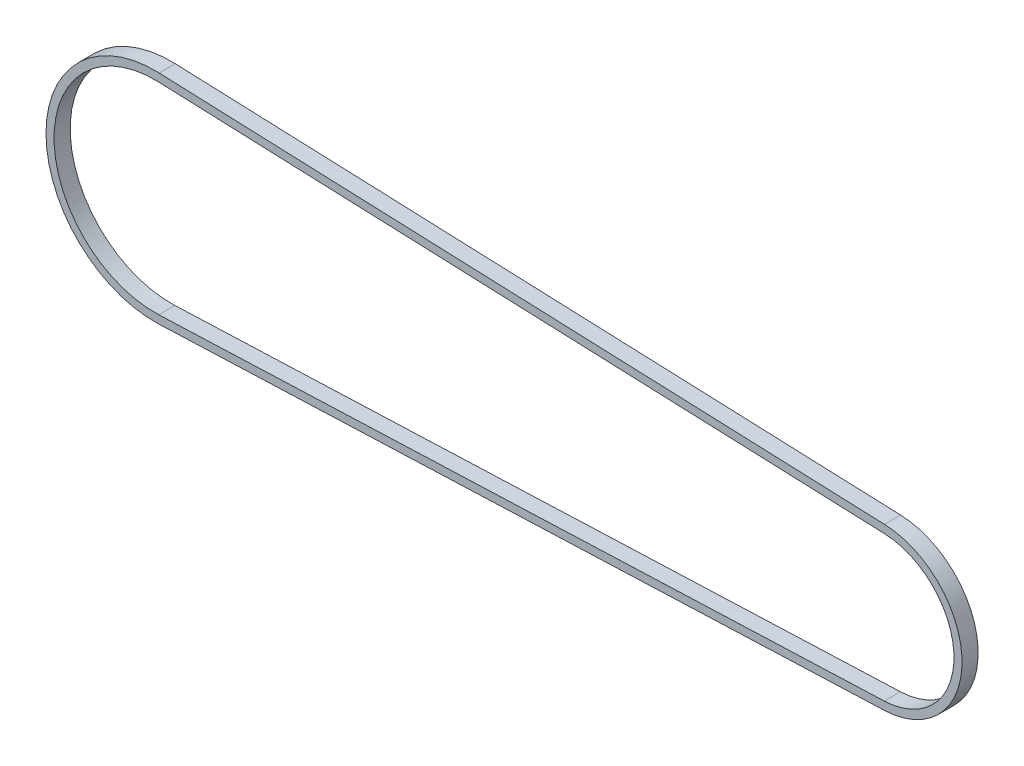
ISO-10303-21;
HEADER;
FILE_DESCRIPTION(('STEP AP214'),'2;1');
FILE_NAME('part.step','',(''),(''),'','','');
FILE_SCHEMA(('AUTOMOTIVE_DESIGN { 1 0 10303 214 1 1 1 1 }'));
ENDSEC;
DATA;
#1=APPLICATION_CONTEXT('core data for automotive mechanical design processes');
#2=APPLICATION_PROTOCOL_DEFINITION('international standard','automotive_design',2000,#1);
#3=PRODUCT_CONTEXT('',#1,'mechanical');
#4=PRODUCT('Part','Part','',(#3));
#5=PRODUCT_RELATED_PRODUCT_CATEGORY('part','',(#4));
#6=PRODUCT_DEFINITION_FORMATION('','',#4);
#7=PRODUCT_DEFINITION_CONTEXT('part definition',#1,'design');
#8=PRODUCT_DEFINITION('design','',#6,#7);
#9=PRODUCT_DEFINITION_SHAPE('','',#8);
#10=(LENGTH_UNIT() NAMED_UNIT(*) SI_UNIT(.MILLI.,.METRE.));
#11=(NAMED_UNIT(*) PLANE_ANGLE_UNIT() SI_UNIT($,.RADIAN.));
#12=(NAMED_UNIT(*) SI_UNIT($,.STERADIAN.) SOLID_ANGLE_UNIT());
#13=UNCERTAINTY_MEASURE_WITH_UNIT(LENGTH_MEASURE(1.E-05),#10,'distance_accuracy_value','');
#14=(GEOMETRIC_REPRESENTATION_CONTEXT(3) GLOBAL_UNCERTAINTY_ASSIGNED_CONTEXT((#13)) GLOBAL_UNIT_ASSIGNED_CONTEXT((#10,
#11,#12)) REPRESENTATION_CONTEXT('',''));
#15=CARTESIAN_POINT('',(0.,0.,0.));
#16=DIRECTION('',(0.,0.,1.));
#17=DIRECTION('',(1.,0.,0.));
#18=AXIS2_PLACEMENT_3D('',#15,#16,#17);
#19=CARTESIAN_POINT('',(-452.430555555556,0.,10.));
#20=DIRECTION('',(0.,0.,1.));
#21=DIRECTION('',(1.,0.,0.));
#22=AXIS2_PLACEMENT_3D('',#19,#20,#21);
#23=PLANE('',#22);
#24=CARTESIAN_POINT('',(-452.430555555556,0.,10.));
#25=DIRECTION('',(0.,0.,1.));
#26=DIRECTION('',(1.,0.,0.));
#27=AXIS2_PLACEMENT_3D('',#24,#25,#26);
#28=CIRCLE('',#27,67.5472429473006);
#29=CARTESIAN_POINT('',(-449.805702422599,67.4962234188851,10.));
#30=VERTEX_POINT('',#29);
#31=CARTESIAN_POINT('',(-449.805702422599,-67.4962234188851,10.));
#32=VERTEX_POINT('',#31);
#33=EDGE_CURVE('E156',#30,#32,#28,.T.);
#34=ORIENTED_EDGE('',*,*,#33,.T.);
#35=DIRECTION('',(0.999244683777023,0.0388595154802176,0.));
#36=VECTOR('',#35,1.);
#37=CARTESIAN_POINT('',(-449.805702422599,-67.4962234188851,10.));
#38=LINE('',#37,#36);
#39=CARTESIAN_POINT('',(0.194297577401026,-49.9962234188851,10.));
#40=VERTEX_POINT('',#39);
#41=EDGE_CURVE('E159',#32,#40,#38,.T.);
#42=ORIENTED_EDGE('',*,*,#41,.T.);
#43=CARTESIAN_POINT('',(-1.75,0.,10.));
#44=DIRECTION('',(0.,0.,1.));
#45=DIRECTION('',(1.,0.,0.));
#46=AXIS2_PLACEMENT_3D('',#43,#44,#45);
#47=CIRCLE('',#46,50.0340149220564);
#48=CARTESIAN_POINT('',(0.194297577401088,49.9962234188851,10.));
#49=VERTEX_POINT('',#48);
#50=EDGE_CURVE('E162',#40,#49,#47,.T.);
#51=ORIENTED_EDGE('',*,*,#50,.T.);
#52=DIRECTION('',(-0.999244683777023,0.0388595154802176,0.));
#53=VECTOR('',#52,1.);
#54=CARTESIAN_POINT('',(-449.805702422599,67.4962234188851,10.));
#55=LINE('',#54,#53);
#56=EDGE_CURVE('E164',#49,#30,#55,.T.);
#57=ORIENTED_EDGE('',*,*,#56,.T.);
#58=EDGE_LOOP('',(#34,#42,#51,#57));
#59=FACE_BOUND('',#58,.T.);
#60=DIRECTION('',(0.999244683777023,0.0388595154802176,0.));
#61=VECTOR('',#60,1.);
#62=CARTESIAN_POINT('',(-450.,-62.5,10.));
#63=LINE('',#62,#61);
#64=CARTESIAN_POINT('',(-450.,-62.5,10.));
#65=VERTEX_POINT('',#64);
#66=CARTESIAN_POINT('',(0.,-45.,10.));
#67=VERTEX_POINT('',#66);
#68=EDGE_CURVE('E128',#65,#67,#63,.T.);
#69=ORIENTED_EDGE('',*,*,#68,.F.);
#70=CARTESIAN_POINT('',(-452.430555555556,0.,10.));
#71=DIRECTION('',(0.,0.,1.));
#72=DIRECTION('',(1.,0.,0.));
#73=AXIS2_PLACEMENT_3D('',#70,#71,#72);
#74=CIRCLE('',#73,62.5472429473006);
#75=CARTESIAN_POINT('',(-450.,62.5,10.));
#76=VERTEX_POINT('',#75);
#77=EDGE_CURVE('E120',#76,#65,#74,.T.);
#78=ORIENTED_EDGE('',*,*,#77,.F.);
#79=DIRECTION('',(-0.999244683777023,0.0388595154802176,0.));
#80=VECTOR('',#79,1.);
#81=CARTESIAN_POINT('',(-450.,62.5,10.));
#82=LINE('',#81,#80);
#83=CARTESIAN_POINT('',(0.,45.,10.));
#84=VERTEX_POINT('',#83);
#85=EDGE_CURVE('E142',#84,#76,#82,.T.);
#86=ORIENTED_EDGE('',*,*,#85,.F.);
#87=CARTESIAN_POINT('',(-1.75,0.,10.));
#88=DIRECTION('',(0.,0.,1.));
#89=DIRECTION('',(-1.,0.,0.));
#90=AXIS2_PLACEMENT_3D('',#87,#88,#89);
#91=CIRCLE('',#90,45.0340149220564);
#92=EDGE_CURVE('E140',#67,#84,#91,.T.);
#93=ORIENTED_EDGE('',*,*,#92,.F.);
#94=EDGE_LOOP('',(#69,#78,#86,#93));
#95=FACE_BOUND('',#94,.T.);
#96=ADVANCED_FACE('F55',(#59,#95),#23,.T.);
#97=CARTESIAN_POINT('',(-452.430555555556,0.,0.));
#98=DIRECTION('',(0.,0.,1.));
#99=DIRECTION('',(1.,0.,0.));
#100=AXIS2_PLACEMENT_3D('',#97,#98,#99);
#101=PLANE('',#100);
#102=CARTESIAN_POINT('',(-452.430555555556,0.,0.));
#103=DIRECTION('',(0.,0.,1.));
#104=DIRECTION('',(1.,0.,0.));
#105=AXIS2_PLACEMENT_3D('',#102,#103,#104);
#106=CIRCLE('',#105,67.5472429473006);
#107=CARTESIAN_POINT('',(-449.805702422599,67.4962234188851,0.));
#108=VERTEX_POINT('',#107);
#109=CARTESIAN_POINT('',(-449.805702422599,-67.4962234188851,0.));
#110=VERTEX_POINT('',#109);
#111=EDGE_CURVE('E136',#108,#110,#106,.T.);
#112=ORIENTED_EDGE('',*,*,#111,.F.);
#113=DIRECTION('',(-0.999244683777023,0.0388595154802176,0.));
#114=VECTOR('',#113,1.);
#115=CARTESIAN_POINT('',(-449.805702422599,67.4962234188851,0.));
#116=LINE('',#115,#114);
#117=CARTESIAN_POINT('',(0.194297577401088,49.9962234188851,0.));
#118=VERTEX_POINT('',#117);
#119=EDGE_CURVE('E160',#118,#108,#116,.T.);
#120=ORIENTED_EDGE('',*,*,#119,.F.);
#121=CARTESIAN_POINT('',(-1.75,0.,0.));
#122=DIRECTION('',(0.,0.,1.));
#123=DIRECTION('',(1.,0.,0.));
#124=AXIS2_PLACEMENT_3D('',#121,#122,#123);
#125=CIRCLE('',#124,50.0340149220564);
#126=CARTESIAN_POINT('',(0.194297577401026,-49.9962234188851,0.));
#127=VERTEX_POINT('',#126);
#128=EDGE_CURVE('E171',#127,#118,#125,.T.);
#129=ORIENTED_EDGE('',*,*,#128,.F.);
#130=DIRECTION('',(0.999244683777023,0.0388595154802176,0.));
#131=VECTOR('',#130,1.);
#132=CARTESIAN_POINT('',(-449.805702422599,-67.4962234188851,0.));
#133=LINE('',#132,#131);
#134=EDGE_CURVE('E169',#110,#127,#133,.T.);
#135=ORIENTED_EDGE('',*,*,#134,.F.);
#136=EDGE_LOOP('',(#112,#120,#129,#135));
#137=FACE_BOUND('',#136,.T.);
#138=CARTESIAN_POINT('',(-452.430555555556,0.,0.));
#139=DIRECTION('',(0.,0.,1.));
#140=DIRECTION('',(1.,0.,0.));
#141=AXIS2_PLACEMENT_3D('',#138,#139,#140);
#142=CIRCLE('',#141,62.5472429473006);
#143=CARTESIAN_POINT('',(-450.,62.5,0.));
#144=VERTEX_POINT('',#143);
#145=CARTESIAN_POINT('',(-450.,-62.5,0.));
#146=VERTEX_POINT('',#145);
#147=EDGE_CURVE('E78',#144,#146,#142,.T.);
#148=ORIENTED_EDGE('',*,*,#147,.T.);
#149=DIRECTION('',(0.999244683777023,0.0388595154802176,0.));
#150=VECTOR('',#149,1.);
#151=CARTESIAN_POINT('',(-450.,-62.5,0.));
#152=LINE('',#151,#150);
#153=CARTESIAN_POINT('',(0.,-45.,0.));
#154=VERTEX_POINT('',#153);
#155=EDGE_CURVE('E135',#146,#154,#152,.T.);
#156=ORIENTED_EDGE('',*,*,#155,.T.);
#157=CARTESIAN_POINT('',(-1.75,0.,0.));
#158=DIRECTION('',(0.,0.,1.));
#159=DIRECTION('',(-1.,0.,0.));
#160=AXIS2_PLACEMENT_3D('',#157,#158,#159);
#161=CIRCLE('',#160,45.0340149220564);
#162=CARTESIAN_POINT('',(0.,45.,0.));
#163=VERTEX_POINT('',#162);
#164=EDGE_CURVE('E148',#154,#163,#161,.T.);
#165=ORIENTED_EDGE('',*,*,#164,.T.);
#166=DIRECTION('',(-0.999244683777023,0.0388595154802176,0.));
#167=VECTOR('',#166,1.);
#168=CARTESIAN_POINT('',(-450.,62.5,0.));
#169=LINE('',#168,#167);
#170=EDGE_CURVE('E129',#163,#144,#169,.T.);
#171=ORIENTED_EDGE('',*,*,#170,.T.);
#172=EDGE_LOOP('',(#148,#156,#165,#171));
#173=FACE_BOUND('',#172,.T.);
#174=ADVANCED_FACE('F189',(#137,#173),#101,.F.);
#175=CARTESIAN_POINT('',(-452.430555555556,0.,10.));
#176=DIRECTION('',(0.,0.,-1.));
#177=DIRECTION('',(-1.,0.,0.));
#178=AXIS2_PLACEMENT_3D('',#175,#176,#177);
#179=CYLINDRICAL_SURFACE('',#178,67.5472429473006);
#180=ORIENTED_EDGE('',*,*,#111,.T.);
#181=DIRECTION('',(0.,0.,-1.));
#182=VECTOR('',#181,1.);
#183=CARTESIAN_POINT('',(-449.805702422599,-67.4962234188851,10.));
#184=LINE('',#183,#182);
#185=EDGE_CURVE('E12',#32,#110,#184,.T.);
#186=ORIENTED_EDGE('',*,*,#185,.F.);
#187=ORIENTED_EDGE('',*,*,#33,.F.);
#188=DIRECTION('',(0.,0.,-1.));
#189=VECTOR('',#188,1.);
#190=CARTESIAN_POINT('',(-449.805702422599,67.4962234188851,10.));
#191=LINE('',#190,#189);
#192=EDGE_CURVE('E166',#30,#108,#191,.T.);
#193=ORIENTED_EDGE('',*,*,#192,.T.);
#194=EDGE_LOOP('',(#180,#186,#187,#193));
#195=FACE_BOUND('',#194,.T.);
#196=ADVANCED_FACE('F57',(#195),#179,.T.);
#197=CARTESIAN_POINT('',(-449.805702422599,-67.4962234188851,10.));
#198=DIRECTION('',(-0.0388595154802176,0.999244683777023,0.));
#199=DIRECTION('',(-0.999244683777023,-0.0388595154802176,0.));
#200=AXIS2_PLACEMENT_3D('',#197,#198,#199);
#201=PLANE('',#200);
#202=ORIENTED_EDGE('',*,*,#134,.T.);
#203=DIRECTION('',(0.,0.,-1.));
#204=VECTOR('',#203,1.);
#205=CARTESIAN_POINT('',(0.194297577401026,-49.9962234188851,10.));
#206=LINE('',#205,#204);
#207=EDGE_CURVE('E63',#40,#127,#206,.T.);
#208=ORIENTED_EDGE('',*,*,#207,.F.);
#209=ORIENTED_EDGE('',*,*,#41,.F.);
#210=ORIENTED_EDGE('',*,*,#185,.T.);
#211=EDGE_LOOP('',(#202,#208,#209,#210));
#212=FACE_BOUND('',#211,.T.);
#213=ADVANCED_FACE('F199',(#212),#201,.F.);
#214=CARTESIAN_POINT('',(-1.75,0.,10.));
#215=DIRECTION('',(0.,0.,-1.));
#216=DIRECTION('',(-1.,0.,0.));
#217=AXIS2_PLACEMENT_3D('',#214,#215,#216);
#218=CYLINDRICAL_SURFACE('',#217,50.0340149220564);
#219=ORIENTED_EDGE('',*,*,#128,.T.);
#220=DIRECTION('',(0.,0.,-1.));
#221=VECTOR('',#220,1.);
#222=CARTESIAN_POINT('',(0.194297577401088,49.9962234188851,10.));
#223=LINE('',#222,#221);
#224=EDGE_CURVE('E176',#49,#118,#223,.T.);
#225=ORIENTED_EDGE('',*,*,#224,.F.);
#226=ORIENTED_EDGE('',*,*,#50,.F.);
#227=ORIENTED_EDGE('',*,*,#207,.T.);
#228=EDGE_LOOP('',(#219,#225,#226,#227));
#229=FACE_BOUND('',#228,.T.);
#230=ADVANCED_FACE('F183',(#229),#218,.T.);
#231=CARTESIAN_POINT('',(-449.805702422599,67.4962234188851,10.));
#232=DIRECTION('',(-0.0388595154802176,-0.999244683777023,0.));
#233=DIRECTION('',(0.999244683777023,-0.0388595154802176,0.));
#234=AXIS2_PLACEMENT_3D('',#231,#232,#233);
#235=PLANE('',#234);
#236=ORIENTED_EDGE('',*,*,#119,.T.);
#237=ORIENTED_EDGE('',*,*,#192,.F.);
#238=ORIENTED_EDGE('',*,*,#56,.F.);
#239=ORIENTED_EDGE('',*,*,#224,.T.);
#240=EDGE_LOOP('',(#236,#237,#238,#239));
#241=FACE_BOUND('',#240,.T.);
#242=ADVANCED_FACE('F193',(#241),#235,.F.);
#243=CARTESIAN_POINT('',(-452.430555555556,0.,10.));
#244=DIRECTION('',(0.,0.,-1.));
#245=DIRECTION('',(-1.,0.,0.));
#246=AXIS2_PLACEMENT_3D('',#243,#244,#245);
#247=CYLINDRICAL_SURFACE('',#246,62.5472429473006);
#248=ORIENTED_EDGE('',*,*,#147,.F.);
#249=DIRECTION('',(0.,0.,-1.));
#250=VECTOR('',#249,1.);
#251=CARTESIAN_POINT('',(-450.,62.5,10.));
#252=LINE('',#251,#250);
#253=EDGE_CURVE('E124',#76,#144,#252,.T.);
#254=ORIENTED_EDGE('',*,*,#253,.F.);
#255=ORIENTED_EDGE('',*,*,#77,.T.);
#256=DIRECTION('',(0.,0.,-1.));
#257=VECTOR('',#256,1.);
#258=CARTESIAN_POINT('',(-450.,-62.5,10.));
#259=LINE('',#258,#257);
#260=EDGE_CURVE('E123',#65,#146,#259,.T.);
#261=ORIENTED_EDGE('',*,*,#260,.T.);
#262=EDGE_LOOP('',(#248,#254,#255,#261));
#263=FACE_BOUND('',#262,.T.);
#264=ADVANCED_FACE('F122',(#263),#247,.F.);
#265=CARTESIAN_POINT('',(-450.,-62.5,10.));
#266=DIRECTION('',(-0.0388595154802176,0.999244683777023,0.));
#267=DIRECTION('',(-0.999244683777023,-0.0388595154802176,0.));
#268=AXIS2_PLACEMENT_3D('',#265,#266,#267);
#269=PLANE('',#268);
#270=ORIENTED_EDGE('',*,*,#155,.F.);
#271=ORIENTED_EDGE('',*,*,#260,.F.);
#272=ORIENTED_EDGE('',*,*,#68,.T.);
#273=DIRECTION('',(0.,0.,-1.));
#274=VECTOR('',#273,1.);
#275=CARTESIAN_POINT('',(0.,-45.,10.));
#276=LINE('',#275,#274);
#277=EDGE_CURVE('E137',#67,#154,#276,.T.);
#278=ORIENTED_EDGE('',*,*,#277,.T.);
#279=EDGE_LOOP('',(#270,#271,#272,#278));
#280=FACE_BOUND('',#279,.T.);
#281=ADVANCED_FACE('F132',(#280),#269,.T.);
#282=CARTESIAN_POINT('',(-1.75,0.,10.));
#283=DIRECTION('',(0.,0.,-1.));
#284=DIRECTION('',(-1.,0.,0.));
#285=AXIS2_PLACEMENT_3D('',#282,#283,#284);
#286=CYLINDRICAL_SURFACE('',#285,45.0340149220564);
#287=ORIENTED_EDGE('',*,*,#164,.F.);
#288=ORIENTED_EDGE('',*,*,#277,.F.);
#289=ORIENTED_EDGE('',*,*,#92,.T.);
#290=DIRECTION('',(0.,0.,-1.));
#291=VECTOR('',#290,1.);
#292=CARTESIAN_POINT('',(0.,45.,10.));
#293=LINE('',#292,#291);
#294=EDGE_CURVE('E70',#84,#163,#293,.T.);
#295=ORIENTED_EDGE('',*,*,#294,.T.);
#296=EDGE_LOOP('',(#287,#288,#289,#295));
#297=FACE_BOUND('',#296,.T.);
#298=ADVANCED_FACE('F222',(#297),#286,.F.);
#299=CARTESIAN_POINT('',(-450.,62.5,10.));
#300=DIRECTION('',(-0.0388595154802176,-0.999244683777023,0.));
#301=DIRECTION('',(0.999244683777023,-0.0388595154802176,0.));
#302=AXIS2_PLACEMENT_3D('',#299,#300,#301);
#303=PLANE('',#302);
#304=ORIENTED_EDGE('',*,*,#170,.F.);
#305=ORIENTED_EDGE('',*,*,#294,.F.);
#306=ORIENTED_EDGE('',*,*,#85,.T.);
#307=ORIENTED_EDGE('',*,*,#253,.T.);
#308=EDGE_LOOP('',(#304,#305,#306,#307));
#309=FACE_BOUND('',#308,.T.);
#310=ADVANCED_FACE('F226',(#309),#303,.T.);
#311=CLOSED_SHELL('',(#96,#174,#196,#213,#230,#242,#264,#281,#298,#310));
#312=MANIFOLD_SOLID_BREP('B2',#311);
#313=ADVANCED_BREP_SHAPE_REPRESENTATION('',(#18,#312),#14);
#314=SHAPE_DEFINITION_REPRESENTATION(#9,#313);
ENDSEC;
END-ISO-10303-21;
